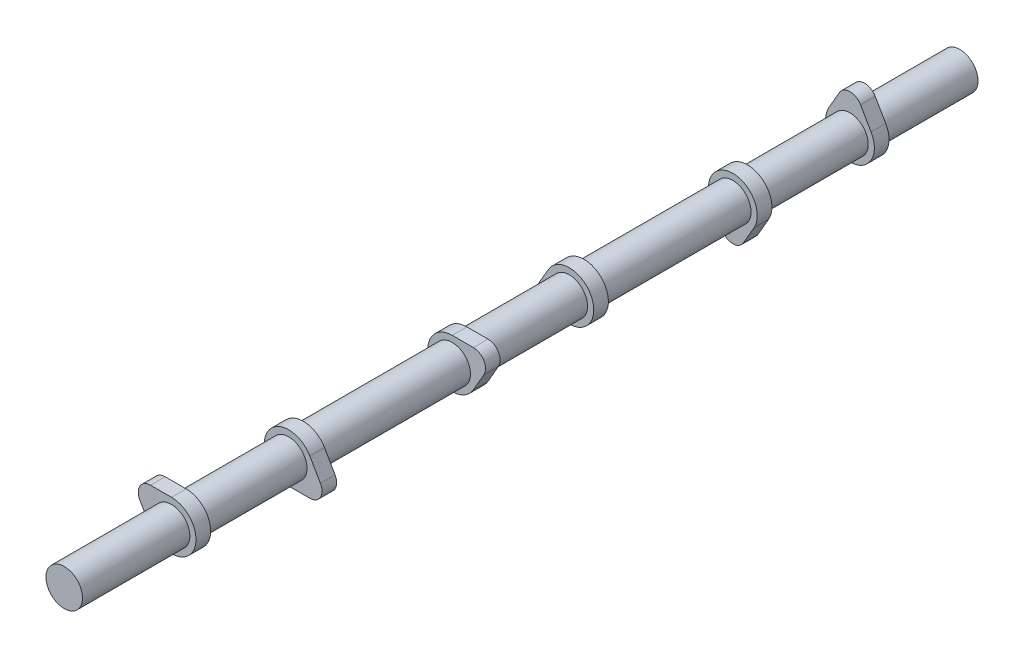
ISO-10303-21;
HEADER;
FILE_DESCRIPTION(('STEP AP214'),'2;1');
FILE_NAME('part.step','',(''),(''),'','','');
FILE_SCHEMA(('AUTOMOTIVE_DESIGN { 1 0 10303 214 1 1 1 1 }'));
ENDSEC;
DATA;
#1=APPLICATION_CONTEXT('core data for automotive mechanical design processes');
#2=APPLICATION_PROTOCOL_DEFINITION('international standard','automotive_design',2000,#1);
#3=PRODUCT_CONTEXT('',#1,'mechanical');
#4=PRODUCT('Part','Part','',(#3));
#5=PRODUCT_RELATED_PRODUCT_CATEGORY('part','',(#4));
#6=PRODUCT_DEFINITION_FORMATION('','',#4);
#7=PRODUCT_DEFINITION_CONTEXT('part definition',#1,'design');
#8=PRODUCT_DEFINITION('design','',#6,#7);
#9=PRODUCT_DEFINITION_SHAPE('','',#8);
#10=(LENGTH_UNIT() NAMED_UNIT(*) SI_UNIT(.MILLI.,.METRE.));
#11=(NAMED_UNIT(*) PLANE_ANGLE_UNIT() SI_UNIT($,.RADIAN.));
#12=(NAMED_UNIT(*) SI_UNIT($,.STERADIAN.) SOLID_ANGLE_UNIT());
#13=UNCERTAINTY_MEASURE_WITH_UNIT(LENGTH_MEASURE(1.E-05),#10,'distance_accuracy_value','');
#14=(GEOMETRIC_REPRESENTATION_CONTEXT(3) GLOBAL_UNCERTAINTY_ASSIGNED_CONTEXT((#13)) GLOBAL_UNIT_ASSIGNED_CONTEXT((#10,
#11,#12)) REPRESENTATION_CONTEXT('',''));
#15=CARTESIAN_POINT('',(0.,0.,0.));
#16=DIRECTION('',(0.,0.,1.));
#17=DIRECTION('',(1.,0.,0.));
#18=AXIS2_PLACEMENT_3D('',#15,#16,#17);
#19=CARTESIAN_POINT('',(0.,0.,412.75));
#20=DIRECTION('',(0.,0.,-1.));
#21=DIRECTION('',(0.499999999999992,0.866025403784443,0.));
#22=AXIS2_PLACEMENT_3D('',#19,#20,#21);
#23=CYLINDRICAL_SURFACE('',#22,9.5);
#24=CARTESIAN_POINT('',(0.,0.,295.91));
#25=DIRECTION('',(0.,0.,1.));
#26=DIRECTION('',(-0.499999999999992,-0.866025403784443,0.));
#27=AXIS2_PLACEMENT_3D('',#24,#25,#26);
#28=CIRCLE('',#27,9.5);
#29=CARTESIAN_POINT('',(-4.74999999999992,-8.22724133595221,295.91));
#30=VERTEX_POINT('',#29);
#31=EDGE_CURVE('E457',#30,#30,#28,.F.);
#32=ORIENTED_EDGE('',*,*,#31,.F.);
#33=EDGE_LOOP('',(#32));
#34=FACE_BOUND('',#33,.T.);
#35=CARTESIAN_POINT('',(0.,0.,349.25));
#36=DIRECTION('',(0.,0.,1.));
#37=DIRECTION('',(-0.499999999999992,-0.866025403784443,0.));
#38=AXIS2_PLACEMENT_3D('',#35,#36,#37);
#39=CIRCLE('',#38,9.5);
#40=CARTESIAN_POINT('',(-4.74999999999992,-8.22724133595221,349.25));
#41=VERTEX_POINT('',#40);
#42=EDGE_CURVE('E11',#41,#41,#39,.T.);
#43=ORIENTED_EDGE('',*,*,#42,.F.);
#44=EDGE_LOOP('',(#43));
#45=FACE_BOUND('',#44,.T.);
#46=ADVANCED_FACE('F45',(#34,#45),#23,.T.);
#47=CARTESIAN_POINT('',(10.9985226280624,-6.3499999999999,295.91));
#48=DIRECTION('',(0.,0.,-1.));
#49=DIRECTION('',(0.499999999999992,0.866025403784443,0.));
#50=AXIS2_PLACEMENT_3D('',#47,#48,#49);
#51=CYLINDRICAL_SURFACE('',#50,6.35);
#52=CARTESIAN_POINT('',(10.9985226280624,-6.3499999999999,288.29));
#53=DIRECTION('',(0.,0.,1.));
#54=DIRECTION('',(-0.499999999999992,-0.866025403784443,0.));
#55=AXIS2_PLACEMENT_3D('',#52,#53,#54);
#56=CIRCLE('',#55,6.35);
#57=CARTESIAN_POINT('',(10.9985226280625,-12.6999999999999,288.29));
#58=VERTEX_POINT('',#57);
#59=CARTESIAN_POINT('',(16.4977839420936,-3.17499999999985,288.29));
#60=VERTEX_POINT('',#59);
#61=EDGE_CURVE('E461',#58,#60,#56,.T.);
#62=ORIENTED_EDGE('',*,*,#61,.T.);
#63=DIRECTION('',(0.,0.,-1.));
#64=VECTOR('',#63,1.);
#65=CARTESIAN_POINT('',(16.4977839420936,-3.17499999999985,295.91));
#66=LINE('',#65,#64);
#67=CARTESIAN_POINT('',(16.4977839420936,-3.17499999999985,295.91));
#68=VERTEX_POINT('',#67);
#69=EDGE_CURVE('E491',#68,#60,#66,.T.);
#70=ORIENTED_EDGE('',*,*,#69,.F.);
#71=CARTESIAN_POINT('',(10.9985226280624,-6.3499999999999,295.91));
#72=DIRECTION('',(0.,0.,1.));
#73=DIRECTION('',(-0.499999999999992,-0.866025403784443,0.));
#74=AXIS2_PLACEMENT_3D('',#71,#72,#73);
#75=CIRCLE('',#74,6.35);
#76=CARTESIAN_POINT('',(10.9985226280625,-12.6999999999999,295.91));
#77=VERTEX_POINT('',#76);
#78=EDGE_CURVE('E462',#77,#68,#75,.T.);
#79=ORIENTED_EDGE('',*,*,#78,.F.);
#80=DIRECTION('',(0.,0.,-1.));
#81=VECTOR('',#80,1.);
#82=CARTESIAN_POINT('',(10.9985226280625,-12.6999999999999,295.91));
#83=LINE('',#82,#81);
#84=EDGE_CURVE('E472',#77,#58,#83,.T.);
#85=ORIENTED_EDGE('',*,*,#84,.T.);
#86=EDGE_LOOP('',(#62,#70,#79,#85));
#87=FACE_BOUND('',#86,.T.);
#88=ADVANCED_FACE('F47',(#87),#51,.T.);
#89=CARTESIAN_POINT('',(16.4977839420936,-3.17499999999985,295.91));
#90=DIRECTION('',(-0.866025403784434,-0.500000000000008,0.));
#91=DIRECTION('',(0.500000000000008,-0.866025403784434,0.));
#92=AXIS2_PLACEMENT_3D('',#89,#90,#91);
#93=PLANE('',#92);
#94=DIRECTION('',(-0.500000000000008,0.866025403784434,0.));
#95=VECTOR('',#94,1.);
#96=CARTESIAN_POINT('',(16.4977839420936,-3.17499999999985,288.29));
#97=LINE('',#96,#95);
#98=CARTESIAN_POINT('',(10.9985226280623,6.3500000000001,288.29));
#99=VERTEX_POINT('',#98);
#100=EDGE_CURVE('E476',#60,#99,#97,.T.);
#101=ORIENTED_EDGE('',*,*,#100,.T.);
#102=DIRECTION('',(0.,0.,-1.));
#103=VECTOR('',#102,1.);
#104=CARTESIAN_POINT('',(10.9985226280623,6.3500000000001,295.91));
#105=LINE('',#104,#103);
#106=CARTESIAN_POINT('',(10.9985226280623,6.3500000000001,295.91));
#107=VERTEX_POINT('',#106);
#108=EDGE_CURVE('E488',#107,#99,#105,.T.);
#109=ORIENTED_EDGE('',*,*,#108,.F.);
#110=DIRECTION('',(-0.500000000000008,0.866025403784434,0.));
#111=VECTOR('',#110,1.);
#112=CARTESIAN_POINT('',(16.4977839420936,-3.17499999999985,295.91));
#113=LINE('',#112,#111);
#114=EDGE_CURVE('E96',#68,#107,#113,.T.);
#115=ORIENTED_EDGE('',*,*,#114,.F.);
#116=ORIENTED_EDGE('',*,*,#69,.T.);
#117=EDGE_LOOP('',(#101,#109,#115,#116));
#118=FACE_BOUND('',#117,.T.);
#119=ADVANCED_FACE('F513',(#118),#93,.F.);
#120=CARTESIAN_POINT('',(0.,0.,295.91));
#121=DIRECTION('',(0.,0.,-1.));
#122=DIRECTION('',(0.499999999999992,0.866025403784443,0.));
#123=AXIS2_PLACEMENT_3D('',#120,#121,#122);
#124=CYLINDRICAL_SURFACE('',#123,12.7);
#125=CARTESIAN_POINT('',(0.,0.,288.29));
#126=DIRECTION('',(0.,0.,1.));
#127=DIRECTION('',(-0.499999999999992,-0.866025403784443,0.));
#128=AXIS2_PLACEMENT_3D('',#125,#126,#127);
#129=CIRCLE('',#128,12.7);
#130=CARTESIAN_POINT('',(1.196959198424E-13,-12.7,288.29));
#131=VERTEX_POINT('',#130);
#132=EDGE_CURVE('E82',#99,#131,#129,.T.);
#133=ORIENTED_EDGE('',*,*,#132,.T.);
#134=DIRECTION('',(0.,0.,-1.));
#135=VECTOR('',#134,1.);
#136=CARTESIAN_POINT('',(1.196959198424E-13,-12.7,295.91));
#137=LINE('',#136,#135);
#138=CARTESIAN_POINT('',(1.196959198424E-13,-12.7,295.91));
#139=VERTEX_POINT('',#138);
#140=EDGE_CURVE('E485',#139,#131,#137,.T.);
#141=ORIENTED_EDGE('',*,*,#140,.F.);
#142=CARTESIAN_POINT('',(0.,0.,295.91));
#143=DIRECTION('',(0.,0.,1.));
#144=DIRECTION('',(-0.499999999999992,-0.866025403784443,0.));
#145=AXIS2_PLACEMENT_3D('',#142,#143,#144);
#146=CIRCLE('',#145,12.7);
#147=EDGE_CURVE('E467',#107,#139,#146,.T.);
#148=ORIENTED_EDGE('',*,*,#147,.F.);
#149=ORIENTED_EDGE('',*,*,#108,.T.);
#150=EDGE_LOOP('',(#133,#141,#148,#149));
#151=FACE_BOUND('',#150,.T.);
#152=ADVANCED_FACE('F512',(#151),#124,.T.);
#153=CARTESIAN_POINT('',(10.9985226280625,-12.6999999999999,295.91));
#154=DIRECTION('',(0.,1.,0.));
#155=DIRECTION('',(-1.,0.,0.));
#156=AXIS2_PLACEMENT_3D('',#153,#154,#155);
#157=PLANE('',#156);
#158=DIRECTION('',(1.,0.,0.));
#159=VECTOR('',#158,1.);
#160=CARTESIAN_POINT('',(10.9985226280625,-12.6999999999999,288.29));
#161=LINE('',#160,#159);
#162=EDGE_CURVE('E88',#131,#58,#161,.T.);
#163=ORIENTED_EDGE('',*,*,#162,.T.);
#164=ORIENTED_EDGE('',*,*,#84,.F.);
#165=DIRECTION('',(1.,0.,0.));
#166=VECTOR('',#165,1.);
#167=CARTESIAN_POINT('',(10.9985226280625,-12.6999999999999,295.91));
#168=LINE('',#167,#166);
#169=EDGE_CURVE('E64',#139,#77,#168,.T.);
#170=ORIENTED_EDGE('',*,*,#169,.F.);
#171=ORIENTED_EDGE('',*,*,#140,.T.);
#172=EDGE_LOOP('',(#163,#164,#170,#171));
#173=FACE_BOUND('',#172,.T.);
#174=ADVANCED_FACE('F510',(#173),#157,.F.);
#175=CARTESIAN_POINT('',(10.9985226280624,-6.3499999999999,295.91));
#176=DIRECTION('',(0.,0.,1.));
#177=DIRECTION('',(-0.499999999999992,-0.866025403784443,0.));
#178=AXIS2_PLACEMENT_3D('',#175,#176,#177);
#179=PLANE('',#178);
#180=ORIENTED_EDGE('',*,*,#31,.T.);
#181=EDGE_LOOP('',(#180));
#182=FACE_BOUND('',#181,.T.);
#183=ORIENTED_EDGE('',*,*,#78,.T.);
#184=ORIENTED_EDGE('',*,*,#114,.T.);
#185=ORIENTED_EDGE('',*,*,#147,.T.);
#186=ORIENTED_EDGE('',*,*,#169,.T.);
#187=EDGE_LOOP('',(#183,#184,#185,#186));
#188=FACE_BOUND('',#187,.T.);
#189=ADVANCED_FACE('F504',(#182,#188),#179,.T.);
#190=CARTESIAN_POINT('',(10.9985226280624,-6.3499999999999,288.29));
#191=DIRECTION('',(0.,0.,1.));
#192=DIRECTION('',(-0.499999999999992,-0.866025403784443,0.));
#193=AXIS2_PLACEMENT_3D('',#190,#191,#192);
#194=PLANE('',#193);
#195=CARTESIAN_POINT('',(0.,0.,288.29));
#196=DIRECTION('',(0.,0.,1.));
#197=DIRECTION('',(-0.499999999999992,-0.866025403784443,0.));
#198=AXIS2_PLACEMENT_3D('',#195,#196,#197);
#199=CIRCLE('',#198,9.5);
#200=CARTESIAN_POINT('',(-4.74999999999992,-8.22724133595221,288.29));
#201=VERTEX_POINT('',#200);
#202=EDGE_CURVE('E56',#201,#201,#199,.F.);
#203=ORIENTED_EDGE('',*,*,#202,.F.);
#204=EDGE_LOOP('',(#203));
#205=FACE_BOUND('',#204,.T.);
#206=ORIENTED_EDGE('',*,*,#61,.F.);
#207=ORIENTED_EDGE('',*,*,#162,.F.);
#208=ORIENTED_EDGE('',*,*,#132,.F.);
#209=ORIENTED_EDGE('',*,*,#100,.F.);
#210=EDGE_LOOP('',(#206,#207,#208,#209));
#211=FACE_BOUND('',#210,.T.);
#212=ADVANCED_FACE('F501',(#205,#211),#194,.F.);
#213=ORIENTED_EDGE('',*,*,#202,.T.);
#214=EDGE_LOOP('',(#213));
#215=FACE_BOUND('',#214,.T.);
#216=CARTESIAN_POINT('',(0.,0.,210.82));
#217=DIRECTION('',(0.,0.,1.));
#218=DIRECTION('',(-0.500000000000004,0.866025403784436,0.));
#219=AXIS2_PLACEMENT_3D('',#216,#217,#218);
#220=CIRCLE('',#219,9.5);
#221=CARTESIAN_POINT('',(-4.75000000000004,8.22724133595215,210.82));
#222=VERTEX_POINT('',#221);
#223=EDGE_CURVE('E353',#222,#222,#220,.T.);
#224=ORIENTED_EDGE('',*,*,#223,.T.);
#225=EDGE_LOOP('',(#224));
#226=FACE_BOUND('',#225,.T.);
#227=ADVANCED_FACE('F498',(#215,#226),#23,.T.);
#228=CARTESIAN_POINT('',(-10.9985226280624,6.34999999999997,356.87));
#229=DIRECTION('',(0.,0.,-1.));
#230=DIRECTION('',(-0.499999999999998,-0.86602540378444,0.));
#231=AXIS2_PLACEMENT_3D('',#228,#229,#230);
#232=CYLINDRICAL_SURFACE('',#231,6.35);
#233=CARTESIAN_POINT('',(-10.9985226280624,6.34999999999997,349.25));
#234=DIRECTION('',(0.,0.,1.));
#235=DIRECTION('',(0.499999999999998,0.86602540378444,0.));
#236=AXIS2_PLACEMENT_3D('',#233,#234,#235);
#237=CIRCLE('',#236,6.35);
#238=CARTESIAN_POINT('',(-10.9985226280624,12.7,349.25));
#239=VERTEX_POINT('',#238);
#240=CARTESIAN_POINT('',(-16.4977839420936,3.17499999999996,349.25));
#241=VERTEX_POINT('',#240);
#242=EDGE_CURVE('E408',#239,#241,#237,.T.);
#243=ORIENTED_EDGE('',*,*,#242,.T.);
#244=DIRECTION('',(0.,0.,-1.));
#245=VECTOR('',#244,1.);
#246=CARTESIAN_POINT('',(-16.4977839420936,3.17499999999996,356.87));
#247=LINE('',#246,#245);
#248=CARTESIAN_POINT('',(-16.4977839420936,3.17499999999996,356.87));
#249=VERTEX_POINT('',#248);
#250=EDGE_CURVE('E449',#249,#241,#247,.T.);
#251=ORIENTED_EDGE('',*,*,#250,.F.);
#252=CARTESIAN_POINT('',(-10.9985226280624,6.34999999999997,356.87));
#253=DIRECTION('',(0.,0.,1.));
#254=DIRECTION('',(0.499999999999998,0.86602540378444,0.));
#255=AXIS2_PLACEMENT_3D('',#252,#253,#254);
#256=CIRCLE('',#255,6.35);
#257=CARTESIAN_POINT('',(-10.9985226280624,12.7,356.87));
#258=VERTEX_POINT('',#257);
#259=EDGE_CURVE('E412',#258,#249,#256,.T.);
#260=ORIENTED_EDGE('',*,*,#259,.F.);
#261=DIRECTION('',(0.,0.,-1.));
#262=VECTOR('',#261,1.);
#263=CARTESIAN_POINT('',(-10.9985226280624,12.7,356.87));
#264=LINE('',#263,#262);
#265=EDGE_CURVE('E426',#258,#239,#264,.T.);
#266=ORIENTED_EDGE('',*,*,#265,.T.);
#267=EDGE_LOOP('',(#243,#251,#260,#266));
#268=FACE_BOUND('',#267,.T.);
#269=ADVANCED_FACE('F531',(#268),#232,.T.);
#270=CARTESIAN_POINT('',(-16.4977839420936,3.17499999999996,356.87));
#271=DIRECTION('',(0.866025403784437,0.500000000000002,0.));
#272=DIRECTION('',(-0.500000000000002,0.866025403784437,0.));
#273=AXIS2_PLACEMENT_3D('',#270,#271,#272);
#274=PLANE('',#273);
#275=DIRECTION('',(0.500000000000002,-0.866025403784437,0.));
#276=VECTOR('',#275,1.);
#277=CARTESIAN_POINT('',(-16.4977839420936,3.17499999999996,349.25));
#278=LINE('',#277,#276);
#279=CARTESIAN_POINT('',(-10.9985226280624,-6.35000000000002,349.25));
#280=VERTEX_POINT('',#279);
#281=EDGE_CURVE('E430',#241,#280,#278,.T.);
#282=ORIENTED_EDGE('',*,*,#281,.T.);
#283=DIRECTION('',(0.,0.,-1.));
#284=VECTOR('',#283,1.);
#285=CARTESIAN_POINT('',(-10.9985226280624,-6.35000000000002,356.87));
#286=LINE('',#285,#284);
#287=CARTESIAN_POINT('',(-10.9985226280624,-6.35000000000002,356.87));
#288=VERTEX_POINT('',#287);
#289=EDGE_CURVE('E445',#288,#280,#286,.T.);
#290=ORIENTED_EDGE('',*,*,#289,.F.);
#291=DIRECTION('',(0.500000000000002,-0.866025403784437,0.));
#292=VECTOR('',#291,1.);
#293=CARTESIAN_POINT('',(-16.4977839420936,3.17499999999996,356.87));
#294=LINE('',#293,#292);
#295=EDGE_CURVE('E416',#249,#288,#294,.T.);
#296=ORIENTED_EDGE('',*,*,#295,.F.);
#297=ORIENTED_EDGE('',*,*,#250,.T.);
#298=EDGE_LOOP('',(#282,#290,#296,#297));
#299=FACE_BOUND('',#298,.T.);
#300=ADVANCED_FACE('F565',(#299),#274,.F.);
#301=CARTESIAN_POINT('',(0.,0.,356.87));
#302=DIRECTION('',(0.,0.,-1.));
#303=DIRECTION('',(-0.499999999999998,-0.86602540378444,0.));
#304=AXIS2_PLACEMENT_3D('',#301,#302,#303);
#305=CYLINDRICAL_SURFACE('',#304,12.7);
#306=CARTESIAN_POINT('',(0.,0.,349.25));
#307=DIRECTION('',(0.,0.,1.));
#308=DIRECTION('',(0.499999999999998,0.86602540378444,0.));
#309=AXIS2_PLACEMENT_3D('',#306,#307,#308);
#310=CIRCLE('',#309,12.7);
#311=CARTESIAN_POINT('',(0.,12.7,349.25));
#312=VERTEX_POINT('',#311);
#313=EDGE_CURVE('E433',#280,#312,#310,.T.);
#314=ORIENTED_EDGE('',*,*,#313,.T.);
#315=DIRECTION('',(0.,0.,-1.));
#316=VECTOR('',#315,1.);
#317=CARTESIAN_POINT('',(0.,12.7,356.87));
#318=LINE('',#317,#316);
#319=CARTESIAN_POINT('',(0.,12.7,356.87));
#320=VERTEX_POINT('',#319);
#321=EDGE_CURVE('E441',#320,#312,#318,.T.);
#322=ORIENTED_EDGE('',*,*,#321,.F.);
#323=CARTESIAN_POINT('',(0.,0.,356.87));
#324=DIRECTION('',(0.,0.,1.));
#325=DIRECTION('',(0.499999999999998,0.86602540378444,0.));
#326=AXIS2_PLACEMENT_3D('',#323,#324,#325);
#327=CIRCLE('',#326,12.7);
#328=EDGE_CURVE('E420',#288,#320,#327,.T.);
#329=ORIENTED_EDGE('',*,*,#328,.F.);
#330=ORIENTED_EDGE('',*,*,#289,.T.);
#331=EDGE_LOOP('',(#314,#322,#329,#330));
#332=FACE_BOUND('',#331,.T.);
#333=ADVANCED_FACE('F570',(#332),#305,.T.);
#334=CARTESIAN_POINT('',(-10.9985226280624,12.7,356.87));
#335=DIRECTION('',(0.,-1.,0.));
#336=DIRECTION('',(1.,0.,0.));
#337=AXIS2_PLACEMENT_3D('',#334,#335,#336);
#338=PLANE('',#337);
#339=DIRECTION('',(-1.,0.,0.));
#340=VECTOR('',#339,1.);
#341=CARTESIAN_POINT('',(-10.9985226280624,12.7,349.25));
#342=LINE('',#341,#340);
#343=EDGE_CURVE('E417',#312,#239,#342,.T.);
#344=ORIENTED_EDGE('',*,*,#343,.T.);
#345=ORIENTED_EDGE('',*,*,#265,.F.);
#346=DIRECTION('',(-1.,0.,0.));
#347=VECTOR('',#346,1.);
#348=CARTESIAN_POINT('',(-10.9985226280624,12.7,356.87));
#349=LINE('',#348,#347);
#350=EDGE_CURVE('E423',#320,#258,#349,.T.);
#351=ORIENTED_EDGE('',*,*,#350,.F.);
#352=ORIENTED_EDGE('',*,*,#321,.T.);
#353=EDGE_LOOP('',(#344,#345,#351,#352));
#354=FACE_BOUND('',#353,.T.);
#355=ADVANCED_FACE('F555',(#354),#338,.F.);
#356=CARTESIAN_POINT('',(-10.9985226280624,6.34999999999997,356.87));
#357=DIRECTION('',(0.,0.,1.));
#358=DIRECTION('',(0.499999999999998,0.86602540378444,0.));
#359=AXIS2_PLACEMENT_3D('',#356,#357,#358);
#360=PLANE('',#359);
#361=CARTESIAN_POINT('',(0.,0.,356.87));
#362=DIRECTION('',(0.,0.,1.));
#363=DIRECTION('',(-0.499999999999992,-0.866025403784443,0.));
#364=AXIS2_PLACEMENT_3D('',#361,#362,#363);
#365=CIRCLE('',#364,9.5);
#366=CARTESIAN_POINT('',(-4.74999999999992,-8.22724133595221,356.87));
#367=VERTEX_POINT('',#366);
#368=EDGE_CURVE('E49',#367,#367,#365,.T.);
#369=ORIENTED_EDGE('',*,*,#368,.F.);
#370=EDGE_LOOP('',(#369));
#371=FACE_BOUND('',#370,.T.);
#372=ORIENTED_EDGE('',*,*,#259,.T.);
#373=ORIENTED_EDGE('',*,*,#295,.T.);
#374=ORIENTED_EDGE('',*,*,#328,.T.);
#375=ORIENTED_EDGE('',*,*,#350,.T.);
#376=EDGE_LOOP('',(#372,#373,#374,#375));
#377=FACE_BOUND('',#376,.T.);
#378=ADVANCED_FACE('F552',(#371,#377),#360,.T.);
#379=CARTESIAN_POINT('',(-10.9985226280624,6.34999999999997,349.25));
#380=DIRECTION('',(0.,0.,1.));
#381=DIRECTION('',(0.499999999999998,0.86602540378444,0.));
#382=AXIS2_PLACEMENT_3D('',#379,#380,#381);
#383=PLANE('',#382);
#384=ORIENTED_EDGE('',*,*,#42,.T.);
#385=EDGE_LOOP('',(#384));
#386=FACE_BOUND('',#385,.T.);
#387=ORIENTED_EDGE('',*,*,#242,.F.);
#388=ORIENTED_EDGE('',*,*,#343,.F.);
#389=ORIENTED_EDGE('',*,*,#313,.F.);
#390=ORIENTED_EDGE('',*,*,#281,.F.);
#391=EDGE_LOOP('',(#387,#388,#389,#390));
#392=FACE_BOUND('',#391,.T.);
#393=ADVANCED_FACE('F544',(#386,#392),#383,.F.);
#394=CARTESIAN_POINT('',(0.,0.,412.75));
#395=DIRECTION('',(0.,0.,1.));
#396=DIRECTION('',(-0.499999999999992,-0.866025403784443,0.));
#397=AXIS2_PLACEMENT_3D('',#394,#395,#396);
#398=PLANE('',#397);
#399=CARTESIAN_POINT('',(0.,0.,412.75));
#400=DIRECTION('',(0.,0.,1.));
#401=DIRECTION('',(-0.499999999999992,-0.866025403784443,0.));
#402=AXIS2_PLACEMENT_3D('',#399,#400,#401);
#403=CIRCLE('',#402,9.5);
#404=CARTESIAN_POINT('',(-4.74999999999992,-8.22724133595221,412.75));
#405=VERTEX_POINT('',#404);
#406=EDGE_CURVE('E453',#405,#405,#403,.T.);
#407=ORIENTED_EDGE('',*,*,#406,.T.);
#408=EDGE_LOOP('',(#407));
#409=FACE_BOUND('',#408,.T.);
#410=ADVANCED_FACE('F534',(#409),#398,.T.);
#411=ORIENTED_EDGE('',*,*,#368,.T.);
#412=EDGE_LOOP('',(#411));
#413=FACE_BOUND('',#412,.T.);
#414=ORIENTED_EDGE('',*,*,#406,.F.);
#415=EDGE_LOOP('',(#414));
#416=FACE_BOUND('',#415,.T.);
#417=ADVANCED_FACE('F523',(#413,#416),#23,.T.);
#418=CARTESIAN_POINT('',(0.,0.,266.7));
#419=DIRECTION('',(0.,0.,-1.));
#420=DIRECTION('',(0.500000000000004,-0.866025403784436,0.));
#421=AXIS2_PLACEMENT_3D('',#418,#419,#420);
#422=CYLINDRICAL_SURFACE('',#421,9.5);
#423=CARTESIAN_POINT('',(0.,0.,149.86));
#424=DIRECTION('',(0.,0.,1.));
#425=DIRECTION('',(-0.500000000000004,0.866025403784436,0.));
#426=AXIS2_PLACEMENT_3D('',#423,#424,#425);
#427=CIRCLE('',#426,9.5);
#428=CARTESIAN_POINT('',(-4.75000000000004,8.22724133595215,149.86));
#429=VERTEX_POINT('',#428);
#430=EDGE_CURVE('E354',#429,#429,#427,.F.);
#431=ORIENTED_EDGE('',*,*,#430,.F.);
#432=EDGE_LOOP('',(#431));
#433=FACE_BOUND('',#432,.T.);
#434=CARTESIAN_POINT('',(0.,0.,203.2));
#435=DIRECTION('',(0.,0.,1.));
#436=DIRECTION('',(-0.500000000000004,0.866025403784436,0.));
#437=AXIS2_PLACEMENT_3D('',#434,#435,#436);
#438=CIRCLE('',#437,9.5);
#439=CARTESIAN_POINT('',(-4.75000000000004,8.22724133595215,203.2));
#440=VERTEX_POINT('',#439);
#441=EDGE_CURVE('E404',#440,#440,#438,.T.);
#442=ORIENTED_EDGE('',*,*,#441,.F.);
#443=EDGE_LOOP('',(#442));
#444=FACE_BOUND('',#443,.T.);
#445=ADVANCED_FACE('F533',(#433,#444),#422,.T.);
#446=CARTESIAN_POINT('',(-10.9985226280623,-6.35000000000005,149.86));
#447=DIRECTION('',(0.,0.,-1.));
#448=DIRECTION('',(0.500000000000004,-0.866025403784436,0.));
#449=AXIS2_PLACEMENT_3D('',#446,#447,#448);
#450=CYLINDRICAL_SURFACE('',#449,6.35);
#451=CARTESIAN_POINT('',(-10.9985226280623,-6.35000000000005,142.24));
#452=DIRECTION('',(0.,0.,1.));
#453=DIRECTION('',(-0.500000000000004,0.866025403784436,0.));
#454=AXIS2_PLACEMENT_3D('',#451,#452,#453);
#455=CIRCLE('',#454,6.35);
#456=CARTESIAN_POINT('',(-16.4977839420935,-3.17500000000008,142.24));
#457=VERTEX_POINT('',#456);
#458=CARTESIAN_POINT('',(-10.9985226280623,-12.7000000000001,142.24));
#459=VERTEX_POINT('',#458);
#460=EDGE_CURVE('E358',#457,#459,#455,.T.);
#461=ORIENTED_EDGE('',*,*,#460,.T.);
#462=DIRECTION('',(0.,0.,-1.));
#463=VECTOR('',#462,1.);
#464=CARTESIAN_POINT('',(-10.9985226280623,-12.7000000000001,149.86));
#465=LINE('',#464,#463);
#466=CARTESIAN_POINT('',(-10.9985226280623,-12.7000000000001,149.86));
#467=VERTEX_POINT('',#466);
#468=EDGE_CURVE('E396',#467,#459,#465,.T.);
#469=ORIENTED_EDGE('',*,*,#468,.F.);
#470=CARTESIAN_POINT('',(-10.9985226280623,-6.35000000000005,149.86));
#471=DIRECTION('',(0.,0.,1.));
#472=DIRECTION('',(-0.500000000000004,0.866025403784436,0.));
#473=AXIS2_PLACEMENT_3D('',#470,#471,#472);
#474=CIRCLE('',#473,6.35);
#475=CARTESIAN_POINT('',(-16.4977839420935,-3.17500000000008,149.86));
#476=VERTEX_POINT('',#475);
#477=EDGE_CURVE('E359',#476,#467,#474,.T.);
#478=ORIENTED_EDGE('',*,*,#477,.F.);
#479=DIRECTION('',(0.,0.,-1.));
#480=VECTOR('',#479,1.);
#481=CARTESIAN_POINT('',(-16.4977839420935,-3.17500000000008,149.86));
#482=LINE('',#481,#480);
#483=EDGE_CURVE('E373',#476,#457,#482,.T.);
#484=ORIENTED_EDGE('',*,*,#483,.T.);
#485=EDGE_LOOP('',(#461,#469,#478,#484));
#486=FACE_BOUND('',#485,.T.);
#487=ADVANCED_FACE('F540',(#486),#450,.T.);
#488=CARTESIAN_POINT('',(-10.9985226280623,-12.7000000000001,149.86));
#489=DIRECTION('',(0.,1.,0.));
#490=DIRECTION('',(-1.,0.,0.));
#491=AXIS2_PLACEMENT_3D('',#488,#489,#490);
#492=PLANE('',#491);
#493=DIRECTION('',(1.,0.,0.));
#494=VECTOR('',#493,1.);
#495=CARTESIAN_POINT('',(-10.9985226280623,-12.7000000000001,142.24));
#496=LINE('',#495,#494);
#497=CARTESIAN_POINT('',(0.,-12.7,142.24));
#498=VERTEX_POINT('',#497);
#499=EDGE_CURVE('E377',#459,#498,#496,.T.);
#500=ORIENTED_EDGE('',*,*,#499,.T.);
#501=DIRECTION('',(0.,0.,-1.));
#502=VECTOR('',#501,1.);
#503=CARTESIAN_POINT('',(0.,-12.7,149.86));
#504=LINE('',#503,#502);
#505=CARTESIAN_POINT('',(0.,-12.7,149.86));
#506=VERTEX_POINT('',#505);
#507=EDGE_CURVE('E392',#506,#498,#504,.T.);
#508=ORIENTED_EDGE('',*,*,#507,.F.);
#509=DIRECTION('',(1.,0.,0.));
#510=VECTOR('',#509,1.);
#511=CARTESIAN_POINT('',(-10.9985226280623,-12.7000000000001,149.86));
#512=LINE('',#511,#510);
#513=EDGE_CURVE('E363',#467,#506,#512,.T.);
#514=ORIENTED_EDGE('',*,*,#513,.F.);
#515=ORIENTED_EDGE('',*,*,#468,.T.);
#516=EDGE_LOOP('',(#500,#508,#514,#515));
#517=FACE_BOUND('',#516,.T.);
#518=ADVANCED_FACE('F669',(#517),#492,.F.);
#519=CARTESIAN_POINT('',(0.,0.,149.86));
#520=DIRECTION('',(0.,0.,-1.));
#521=DIRECTION('',(0.500000000000004,-0.866025403784436,0.));
#522=AXIS2_PLACEMENT_3D('',#519,#520,#521);
#523=CYLINDRICAL_SURFACE('',#522,12.7);
#524=CARTESIAN_POINT('',(0.,0.,142.24));
#525=DIRECTION('',(0.,0.,1.));
#526=DIRECTION('',(-0.500000000000004,0.866025403784436,0.));
#527=AXIS2_PLACEMENT_3D('',#524,#525,#526);
#528=CIRCLE('',#527,12.7);
#529=CARTESIAN_POINT('',(-10.9985226280624,6.34999999999995,142.24));
#530=VERTEX_POINT('',#529);
#531=EDGE_CURVE('E380',#498,#530,#528,.T.);
#532=ORIENTED_EDGE('',*,*,#531,.T.);
#533=DIRECTION('',(0.,0.,-1.));
#534=VECTOR('',#533,1.);
#535=CARTESIAN_POINT('',(-10.9985226280624,6.34999999999995,149.86));
#536=LINE('',#535,#534);
#537=CARTESIAN_POINT('',(-10.9985226280624,6.34999999999995,149.86));
#538=VERTEX_POINT('',#537);
#539=EDGE_CURVE('E388',#538,#530,#536,.T.);
#540=ORIENTED_EDGE('',*,*,#539,.F.);
#541=CARTESIAN_POINT('',(0.,0.,149.86));
#542=DIRECTION('',(0.,0.,1.));
#543=DIRECTION('',(-0.500000000000004,0.866025403784436,0.));
#544=AXIS2_PLACEMENT_3D('',#541,#542,#543);
#545=CIRCLE('',#544,12.7);
#546=EDGE_CURVE('E367',#506,#538,#545,.T.);
#547=ORIENTED_EDGE('',*,*,#546,.F.);
#548=ORIENTED_EDGE('',*,*,#507,.T.);
#549=EDGE_LOOP('',(#532,#540,#547,#548));
#550=FACE_BOUND('',#549,.T.);
#551=ADVANCED_FACE('F678',(#550),#523,.T.);
#552=CARTESIAN_POINT('',(-16.4977839420935,-3.17500000000008,149.86));
#553=DIRECTION('',(0.866025403784441,-0.499999999999996,0.));
#554=DIRECTION('',(0.499999999999996,0.866025403784441,0.));
#555=AXIS2_PLACEMENT_3D('',#552,#553,#554);
#556=PLANE('',#555);
#557=DIRECTION('',(-0.499999999999996,-0.866025403784441,0.));
#558=VECTOR('',#557,1.);
#559=CARTESIAN_POINT('',(-16.4977839420935,-3.17500000000008,142.24));
#560=LINE('',#559,#558);
#561=EDGE_CURVE('E364',#530,#457,#560,.T.);
#562=ORIENTED_EDGE('',*,*,#561,.T.);
#563=ORIENTED_EDGE('',*,*,#483,.F.);
#564=DIRECTION('',(-0.499999999999996,-0.866025403784441,0.));
#565=VECTOR('',#564,1.);
#566=CARTESIAN_POINT('',(-16.4977839420935,-3.17500000000008,149.86));
#567=LINE('',#566,#565);
#568=EDGE_CURVE('E370',#538,#476,#567,.T.);
#569=ORIENTED_EDGE('',*,*,#568,.F.);
#570=ORIENTED_EDGE('',*,*,#539,.T.);
#571=EDGE_LOOP('',(#562,#563,#569,#570));
#572=FACE_BOUND('',#571,.T.);
#573=ADVANCED_FACE('F688',(#572),#556,.F.);
#574=CARTESIAN_POINT('',(-10.9985226280623,-6.35000000000005,149.86));
#575=DIRECTION('',(0.,0.,1.));
#576=DIRECTION('',(-0.500000000000004,0.866025403784436,0.));
#577=AXIS2_PLACEMENT_3D('',#574,#575,#576);
#578=PLANE('',#577);
#579=ORIENTED_EDGE('',*,*,#430,.T.);
#580=EDGE_LOOP('',(#579));
#581=FACE_BOUND('',#580,.T.);
#582=ORIENTED_EDGE('',*,*,#477,.T.);
#583=ORIENTED_EDGE('',*,*,#513,.T.);
#584=ORIENTED_EDGE('',*,*,#546,.T.);
#585=ORIENTED_EDGE('',*,*,#568,.T.);
#586=EDGE_LOOP('',(#582,#583,#584,#585));
#587=FACE_BOUND('',#586,.T.);
#588=ADVANCED_FACE('F698',(#581,#587),#578,.T.);
#589=CARTESIAN_POINT('',(-10.9985226280623,-6.35000000000005,142.24));
#590=DIRECTION('',(0.,0.,1.));
#591=DIRECTION('',(-0.500000000000004,0.866025403784436,0.));
#592=AXIS2_PLACEMENT_3D('',#589,#590,#591);
#593=PLANE('',#592);
#594=CARTESIAN_POINT('',(0.,0.,142.24));
#595=DIRECTION('',(0.,0.,1.));
#596=DIRECTION('',(-0.500000000000004,0.866025403784436,0.));
#597=AXIS2_PLACEMENT_3D('',#594,#595,#596);
#598=CIRCLE('',#597,9.5);
#599=CARTESIAN_POINT('',(-4.75000000000004,8.22724133595215,142.24));
#600=VERTEX_POINT('',#599);
#601=EDGE_CURVE('E400',#600,#600,#598,.F.);
#602=ORIENTED_EDGE('',*,*,#601,.F.);
#603=EDGE_LOOP('',(#602));
#604=FACE_BOUND('',#603,.T.);
#605=ORIENTED_EDGE('',*,*,#460,.F.);
#606=ORIENTED_EDGE('',*,*,#561,.F.);
#607=ORIENTED_EDGE('',*,*,#531,.F.);
#608=ORIENTED_EDGE('',*,*,#499,.F.);
#609=EDGE_LOOP('',(#605,#606,#607,#608));
#610=FACE_BOUND('',#609,.T.);
#611=ADVANCED_FACE('F708',(#604,#610),#593,.F.);
#612=ORIENTED_EDGE('',*,*,#601,.T.);
#613=EDGE_LOOP('',(#612));
#614=FACE_BOUND('',#613,.T.);
#615=CARTESIAN_POINT('',(0.,0.,64.77));
#616=DIRECTION('',(0.,0.,1.));
#617=DIRECTION('',(1.,0.,0.));
#618=AXIS2_PLACEMENT_3D('',#615,#616,#617);
#619=CIRCLE('',#618,9.5);
#620=CARTESIAN_POINT('',(9.5,0.,64.77));
#621=VERTEX_POINT('',#620);
#622=EDGE_CURVE('E247',#621,#621,#619,.T.);
#623=ORIENTED_EDGE('',*,*,#622,.T.);
#624=EDGE_LOOP('',(#623));
#625=FACE_BOUND('',#624,.T.);
#626=ADVANCED_FACE('F543',(#614,#625),#422,.T.);
#627=CARTESIAN_POINT('',(10.9985226280624,6.34999999999997,210.82));
#628=DIRECTION('',(0.,0.,-1.));
#629=DIRECTION('',(-0.499999999999998,0.86602540378444,0.));
#630=AXIS2_PLACEMENT_3D('',#627,#628,#629);
#631=CYLINDRICAL_SURFACE('',#630,6.35);
#632=CARTESIAN_POINT('',(10.9985226280624,6.34999999999997,203.2));
#633=DIRECTION('',(0.,0.,1.));
#634=DIRECTION('',(0.499999999999998,-0.86602540378444,0.));
#635=AXIS2_PLACEMENT_3D('',#632,#633,#634);
#636=CIRCLE('',#635,6.35);
#637=CARTESIAN_POINT('',(16.4977839420936,3.17499999999996,203.2));
#638=VERTEX_POINT('',#637);
#639=CARTESIAN_POINT('',(10.9985226280624,12.7,203.2));
#640=VERTEX_POINT('',#639);
#641=EDGE_CURVE('E310',#638,#640,#636,.T.);
#642=ORIENTED_EDGE('',*,*,#641,.T.);
#643=DIRECTION('',(0.,0.,-1.));
#644=VECTOR('',#643,1.);
#645=CARTESIAN_POINT('',(10.9985226280624,12.7,210.82));
#646=LINE('',#645,#644);
#647=CARTESIAN_POINT('',(10.9985226280624,12.7,210.82));
#648=VERTEX_POINT('',#647);
#649=EDGE_CURVE('E349',#648,#640,#646,.T.);
#650=ORIENTED_EDGE('',*,*,#649,.F.);
#651=CARTESIAN_POINT('',(10.9985226280624,6.34999999999997,210.82));
#652=DIRECTION('',(0.,0.,1.));
#653=DIRECTION('',(0.499999999999998,-0.86602540378444,0.));
#654=AXIS2_PLACEMENT_3D('',#651,#652,#653);
#655=CIRCLE('',#654,6.35);
#656=CARTESIAN_POINT('',(16.4977839420936,3.17499999999996,210.82));
#657=VERTEX_POINT('',#656);
#658=EDGE_CURVE('E312',#657,#648,#655,.T.);
#659=ORIENTED_EDGE('',*,*,#658,.F.);
#660=DIRECTION('',(0.,0.,-1.));
#661=VECTOR('',#660,1.);
#662=CARTESIAN_POINT('',(16.4977839420936,3.17499999999996,210.82));
#663=LINE('',#662,#661);
#664=EDGE_CURVE('E326',#657,#638,#663,.T.);
#665=ORIENTED_EDGE('',*,*,#664,.T.);
#666=EDGE_LOOP('',(#642,#650,#659,#665));
#667=FACE_BOUND('',#666,.T.);
#668=ADVANCED_FACE('F728',(#667),#631,.T.);
#669=CARTESIAN_POINT('',(10.9985226280624,12.7,210.82));
#670=DIRECTION('',(0.,-1.,0.));
#671=DIRECTION('',(1.,0.,0.));
#672=AXIS2_PLACEMENT_3D('',#669,#670,#671);
#673=PLANE('',#672);
#674=DIRECTION('',(-1.,0.,0.));
#675=VECTOR('',#674,1.);
#676=CARTESIAN_POINT('',(10.9985226280624,12.7,203.2));
#677=LINE('',#676,#675);
#678=CARTESIAN_POINT('',(0.,12.7,203.2));
#679=VERTEX_POINT('',#678);
#680=EDGE_CURVE('E330',#640,#679,#677,.T.);
#681=ORIENTED_EDGE('',*,*,#680,.T.);
#682=DIRECTION('',(0.,0.,-1.));
#683=VECTOR('',#682,1.);
#684=CARTESIAN_POINT('',(0.,12.7,210.82));
#685=LINE('',#684,#683);
#686=CARTESIAN_POINT('',(0.,12.7,210.82));
#687=VERTEX_POINT('',#686);
#688=EDGE_CURVE('E345',#687,#679,#685,.T.);
#689=ORIENTED_EDGE('',*,*,#688,.F.);
#690=DIRECTION('',(-1.,0.,0.));
#691=VECTOR('',#690,1.);
#692=CARTESIAN_POINT('',(10.9985226280624,12.7,210.82));
#693=LINE('',#692,#691);
#694=EDGE_CURVE('E316',#648,#687,#693,.T.);
#695=ORIENTED_EDGE('',*,*,#694,.F.);
#696=ORIENTED_EDGE('',*,*,#649,.T.);
#697=EDGE_LOOP('',(#681,#689,#695,#696));
#698=FACE_BOUND('',#697,.T.);
#699=ADVANCED_FACE('F736',(#698),#673,.F.);
#700=CARTESIAN_POINT('',(0.,0.,210.82));
#701=DIRECTION('',(0.,0.,-1.));
#702=DIRECTION('',(-0.499999999999998,0.86602540378444,0.));
#703=AXIS2_PLACEMENT_3D('',#700,#701,#702);
#704=CYLINDRICAL_SURFACE('',#703,12.7);
#705=CARTESIAN_POINT('',(0.,0.,203.2));
#706=DIRECTION('',(0.,0.,1.));
#707=DIRECTION('',(0.499999999999998,-0.86602540378444,0.));
#708=AXIS2_PLACEMENT_3D('',#705,#706,#707);
#709=CIRCLE('',#708,12.7);
#710=CARTESIAN_POINT('',(10.9985226280624,-6.35000000000003,203.2));
#711=VERTEX_POINT('',#710);
#712=EDGE_CURVE('E333',#679,#711,#709,.T.);
#713=ORIENTED_EDGE('',*,*,#712,.T.);
#714=DIRECTION('',(0.,0.,-1.));
#715=VECTOR('',#714,1.);
#716=CARTESIAN_POINT('',(10.9985226280624,-6.35000000000003,210.82));
#717=LINE('',#716,#715);
#718=CARTESIAN_POINT('',(10.9985226280624,-6.35000000000003,210.82));
#719=VERTEX_POINT('',#718);
#720=EDGE_CURVE('E341',#719,#711,#717,.T.);
#721=ORIENTED_EDGE('',*,*,#720,.F.);
#722=CARTESIAN_POINT('',(0.,0.,210.82));
#723=DIRECTION('',(0.,0.,1.));
#724=DIRECTION('',(0.499999999999998,-0.86602540378444,0.));
#725=AXIS2_PLACEMENT_3D('',#722,#723,#724);
#726=CIRCLE('',#725,12.7);
#727=EDGE_CURVE('E320',#687,#719,#726,.T.);
#728=ORIENTED_EDGE('',*,*,#727,.F.);
#729=ORIENTED_EDGE('',*,*,#688,.T.);
#730=EDGE_LOOP('',(#713,#721,#728,#729));
#731=FACE_BOUND('',#730,.T.);
#732=ADVANCED_FACE('F746',(#731),#704,.T.);
#733=CARTESIAN_POINT('',(16.4977839420936,3.17499999999996,210.82));
#734=DIRECTION('',(-0.866025403784438,0.500000000000002,0.));
#735=DIRECTION('',(-0.500000000000002,-0.866025403784438,0.));
#736=AXIS2_PLACEMENT_3D('',#733,#734,#735);
#737=PLANE('',#736);
#738=DIRECTION('',(0.500000000000002,0.866025403784438,0.));
#739=VECTOR('',#738,1.);
#740=CARTESIAN_POINT('',(16.4977839420936,3.17499999999996,203.2));
#741=LINE('',#740,#739);
#742=EDGE_CURVE('E317',#711,#638,#741,.T.);
#743=ORIENTED_EDGE('',*,*,#742,.T.);
#744=ORIENTED_EDGE('',*,*,#664,.F.);
#745=DIRECTION('',(0.500000000000002,0.866025403784438,0.));
#746=VECTOR('',#745,1.);
#747=CARTESIAN_POINT('',(16.4977839420936,3.17499999999996,210.82));
#748=LINE('',#747,#746);
#749=EDGE_CURVE('E323',#719,#657,#748,.T.);
#750=ORIENTED_EDGE('',*,*,#749,.F.);
#751=ORIENTED_EDGE('',*,*,#720,.T.);
#752=EDGE_LOOP('',(#743,#744,#750,#751));
#753=FACE_BOUND('',#752,.T.);
#754=ADVANCED_FACE('F756',(#753),#737,.F.);
#755=CARTESIAN_POINT('',(10.9985226280624,6.34999999999997,210.82));
#756=DIRECTION('',(0.,0.,1.));
#757=DIRECTION('',(0.499999999999998,-0.86602540378444,0.));
#758=AXIS2_PLACEMENT_3D('',#755,#756,#757);
#759=PLANE('',#758);
#760=ORIENTED_EDGE('',*,*,#223,.F.);
#761=EDGE_LOOP('',(#760));
#762=FACE_BOUND('',#761,.T.);
#763=ORIENTED_EDGE('',*,*,#658,.T.);
#764=ORIENTED_EDGE('',*,*,#694,.T.);
#765=ORIENTED_EDGE('',*,*,#727,.T.);
#766=ORIENTED_EDGE('',*,*,#749,.T.);
#767=EDGE_LOOP('',(#763,#764,#765,#766));
#768=FACE_BOUND('',#767,.T.);
#769=ADVANCED_FACE('F766',(#762,#768),#759,.T.);
#770=CARTESIAN_POINT('',(10.9985226280624,6.34999999999997,203.2));
#771=DIRECTION('',(0.,0.,1.));
#772=DIRECTION('',(0.499999999999998,-0.86602540378444,0.));
#773=AXIS2_PLACEMENT_3D('',#770,#771,#772);
#774=PLANE('',#773);
#775=ORIENTED_EDGE('',*,*,#441,.T.);
#776=EDGE_LOOP('',(#775));
#777=FACE_BOUND('',#776,.T.);
#778=ORIENTED_EDGE('',*,*,#641,.F.);
#779=ORIENTED_EDGE('',*,*,#742,.F.);
#780=ORIENTED_EDGE('',*,*,#712,.F.);
#781=ORIENTED_EDGE('',*,*,#680,.F.);
#782=EDGE_LOOP('',(#778,#779,#780,#781));
#783=FACE_BOUND('',#782,.T.);
#784=ADVANCED_FACE('F776',(#777,#783),#774,.F.);
#785=CARTESIAN_POINT('',(0.,0.,120.65));
#786=DIRECTION('',(0.,0.,-1.));
#787=DIRECTION('',(-1.,0.,0.));
#788=AXIS2_PLACEMENT_3D('',#785,#786,#787);
#789=CYLINDRICAL_SURFACE('',#788,9.5);
#790=CARTESIAN_POINT('',(0.,0.,3.80999999999999));
#791=DIRECTION('',(0.,0.,1.));
#792=DIRECTION('',(1.,0.,0.));
#793=AXIS2_PLACEMENT_3D('',#790,#791,#792);
#794=CIRCLE('',#793,9.5);
#795=CARTESIAN_POINT('',(9.5,0.,3.80999999999999));
#796=VERTEX_POINT('',#795);
#797=EDGE_CURVE('E252',#796,#796,#794,.F.);
#798=ORIENTED_EDGE('',*,*,#797,.F.);
#799=EDGE_LOOP('',(#798));
#800=FACE_BOUND('',#799,.T.);
#801=CARTESIAN_POINT('',(0.,0.,57.15));
#802=DIRECTION('',(0.,0.,1.));
#803=DIRECTION('',(1.,0.,0.));
#804=AXIS2_PLACEMENT_3D('',#801,#802,#803);
#805=CIRCLE('',#804,9.5);
#806=CARTESIAN_POINT('',(9.5,0.,57.15));
#807=VERTEX_POINT('',#806);
#808=EDGE_CURVE('E307',#807,#807,#805,.T.);
#809=ORIENTED_EDGE('',*,*,#808,.F.);
#810=EDGE_LOOP('',(#809));
#811=FACE_BOUND('',#810,.T.);
#812=ADVANCED_FACE('F786',(#800,#811),#789,.T.);
#813=CARTESIAN_POINT('',(0.,12.7,3.81));
#814=DIRECTION('',(0.,0.,-1.));
#815=DIRECTION('',(-1.,0.,0.));
#816=AXIS2_PLACEMENT_3D('',#813,#814,#815);
#817=CYLINDRICAL_SURFACE('',#816,6.35);
#818=CARTESIAN_POINT('',(0.,12.7,-3.81));
#819=DIRECTION('',(0.,0.,1.));
#820=DIRECTION('',(1.,0.,0.));
#821=AXIS2_PLACEMENT_3D('',#818,#819,#820);
#822=CIRCLE('',#821,6.35);
#823=CARTESIAN_POINT('',(5.49926131403118,15.875,-3.81));
#824=VERTEX_POINT('',#823);
#825=CARTESIAN_POINT('',(-5.49926131403118,15.875,-3.81));
#826=VERTEX_POINT('',#825);
#827=EDGE_CURVE('E261',#824,#826,#822,.T.);
#828=ORIENTED_EDGE('',*,*,#827,.T.);
#829=DIRECTION('',(0.,0.,-1.));
#830=VECTOR('',#829,1.);
#831=CARTESIAN_POINT('',(-5.49926131403118,15.875,3.81));
#832=LINE('',#831,#830);
#833=CARTESIAN_POINT('',(-5.49926131403118,15.875,3.81));
#834=VERTEX_POINT('',#833);
#835=EDGE_CURVE('E299',#834,#826,#832,.T.);
#836=ORIENTED_EDGE('',*,*,#835,.F.);
#837=CARTESIAN_POINT('',(0.,12.7,3.81));
#838=DIRECTION('',(0.,0.,1.));
#839=DIRECTION('',(1.,0.,0.));
#840=AXIS2_PLACEMENT_3D('',#837,#838,#839);
#841=CIRCLE('',#840,6.35);
#842=CARTESIAN_POINT('',(5.49926131403118,15.875,3.81));
#843=VERTEX_POINT('',#842);
#844=EDGE_CURVE('E262',#843,#834,#841,.T.);
#845=ORIENTED_EDGE('',*,*,#844,.F.);
#846=DIRECTION('',(0.,0.,-1.));
#847=VECTOR('',#846,1.);
#848=CARTESIAN_POINT('',(5.49926131403118,15.875,3.81));
#849=LINE('',#848,#847);
#850=EDGE_CURVE('E276',#843,#824,#849,.T.);
#851=ORIENTED_EDGE('',*,*,#850,.T.);
#852=EDGE_LOOP('',(#828,#836,#845,#851));
#853=FACE_BOUND('',#852,.T.);
#854=ADVANCED_FACE('F797',(#853),#817,.T.);
#855=CARTESIAN_POINT('',(-5.49926131403118,15.875,3.81));
#856=DIRECTION('',(0.866025403784439,-0.5,0.));
#857=DIRECTION('',(0.5,0.866025403784439,0.));
#858=AXIS2_PLACEMENT_3D('',#855,#856,#857);
#859=PLANE('',#858);
#860=DIRECTION('',(-0.5,-0.866025403784439,0.));
#861=VECTOR('',#860,1.);
#862=CARTESIAN_POINT('',(-5.49926131403118,15.875,-3.81));
#863=LINE('',#862,#861);
#864=CARTESIAN_POINT('',(-10.9985226280624,6.35,-3.81));
#865=VERTEX_POINT('',#864);
#866=EDGE_CURVE('E280',#826,#865,#863,.T.);
#867=ORIENTED_EDGE('',*,*,#866,.T.);
#868=DIRECTION('',(0.,0.,-1.));
#869=VECTOR('',#868,1.);
#870=CARTESIAN_POINT('',(-10.9985226280624,6.35,3.81));
#871=LINE('',#870,#869);
#872=CARTESIAN_POINT('',(-10.9985226280624,6.35,3.81));
#873=VERTEX_POINT('',#872);
#874=EDGE_CURVE('E295',#873,#865,#871,.T.);
#875=ORIENTED_EDGE('',*,*,#874,.F.);
#876=DIRECTION('',(-0.5,-0.866025403784439,0.));
#877=VECTOR('',#876,1.);
#878=CARTESIAN_POINT('',(-5.49926131403118,15.875,3.81));
#879=LINE('',#878,#877);
#880=EDGE_CURVE('E266',#834,#873,#879,.T.);
#881=ORIENTED_EDGE('',*,*,#880,.F.);
#882=ORIENTED_EDGE('',*,*,#835,.T.);
#883=EDGE_LOOP('',(#867,#875,#881,#882));
#884=FACE_BOUND('',#883,.T.);
#885=ADVANCED_FACE('F810',(#884),#859,.F.);
#886=CARTESIAN_POINT('',(0.,0.,3.81));
#887=DIRECTION('',(0.,0.,-1.));
#888=DIRECTION('',(-1.,0.,0.));
#889=AXIS2_PLACEMENT_3D('',#886,#887,#888);
#890=CYLINDRICAL_SURFACE('',#889,12.7);
#891=CARTESIAN_POINT('',(0.,0.,-3.81));
#892=DIRECTION('',(0.,0.,1.));
#893=DIRECTION('',(1.,0.,0.));
#894=AXIS2_PLACEMENT_3D('',#891,#892,#893);
#895=CIRCLE('',#894,12.7);
#896=CARTESIAN_POINT('',(10.9985226280624,6.35,-3.81));
#897=VERTEX_POINT('',#896);
#898=EDGE_CURVE('E283',#865,#897,#895,.T.);
#899=ORIENTED_EDGE('',*,*,#898,.T.);
#900=DIRECTION('',(0.,0.,-1.));
#901=VECTOR('',#900,1.);
#902=CARTESIAN_POINT('',(10.9985226280624,6.35,3.81));
#903=LINE('',#902,#901);
#904=CARTESIAN_POINT('',(10.9985226280624,6.35,3.81));
#905=VERTEX_POINT('',#904);
#906=EDGE_CURVE('E291',#905,#897,#903,.T.);
#907=ORIENTED_EDGE('',*,*,#906,.F.);
#908=CARTESIAN_POINT('',(0.,0.,3.81));
#909=DIRECTION('',(0.,0.,1.));
#910=DIRECTION('',(1.,0.,0.));
#911=AXIS2_PLACEMENT_3D('',#908,#909,#910);
#912=CIRCLE('',#911,12.7);
#913=EDGE_CURVE('E270',#873,#905,#912,.T.);
#914=ORIENTED_EDGE('',*,*,#913,.F.);
#915=ORIENTED_EDGE('',*,*,#874,.T.);
#916=EDGE_LOOP('',(#899,#907,#914,#915));
#917=FACE_BOUND('',#916,.T.);
#918=ADVANCED_FACE('F822',(#917),#890,.T.);
#919=CARTESIAN_POINT('',(5.49926131403118,15.875,3.81));
#920=DIRECTION('',(-0.866025403784439,-0.5,0.));
#921=DIRECTION('',(0.5,-0.866025403784439,0.));
#922=AXIS2_PLACEMENT_3D('',#919,#920,#921);
#923=PLANE('',#922);
#924=DIRECTION('',(-0.5,0.866025403784439,0.));
#925=VECTOR('',#924,1.);
#926=CARTESIAN_POINT('',(5.49926131403118,15.875,-3.81));
#927=LINE('',#926,#925);
#928=EDGE_CURVE('E267',#897,#824,#927,.T.);
#929=ORIENTED_EDGE('',*,*,#928,.T.);
#930=ORIENTED_EDGE('',*,*,#850,.F.);
#931=DIRECTION('',(-0.5,0.866025403784439,0.));
#932=VECTOR('',#931,1.);
#933=CARTESIAN_POINT('',(5.49926131403118,15.875,3.81));
#934=LINE('',#933,#932);
#935=EDGE_CURVE('E273',#905,#843,#934,.T.);
#936=ORIENTED_EDGE('',*,*,#935,.F.);
#937=ORIENTED_EDGE('',*,*,#906,.T.);
#938=EDGE_LOOP('',(#929,#930,#936,#937));
#939=FACE_BOUND('',#938,.T.);
#940=ADVANCED_FACE('F834',(#939),#923,.F.);
#941=CARTESIAN_POINT('',(0.,12.7,3.81));
#942=DIRECTION('',(0.,0.,1.));
#943=DIRECTION('',(1.,0.,0.));
#944=AXIS2_PLACEMENT_3D('',#941,#942,#943);
#945=PLANE('',#944);
#946=ORIENTED_EDGE('',*,*,#797,.T.);
#947=EDGE_LOOP('',(#946));
#948=FACE_BOUND('',#947,.T.);
#949=ORIENTED_EDGE('',*,*,#844,.T.);
#950=ORIENTED_EDGE('',*,*,#880,.T.);
#951=ORIENTED_EDGE('',*,*,#913,.T.);
#952=ORIENTED_EDGE('',*,*,#935,.T.);
#953=EDGE_LOOP('',(#949,#950,#951,#952));
#954=FACE_BOUND('',#953,.T.);
#955=ADVANCED_FACE('F846',(#948,#954),#945,.T.);
#956=CARTESIAN_POINT('',(0.,12.7,-3.81));
#957=DIRECTION('',(0.,0.,1.));
#958=DIRECTION('',(1.,0.,0.));
#959=AXIS2_PLACEMENT_3D('',#956,#957,#958);
#960=PLANE('',#959);
#961=CARTESIAN_POINT('',(0.,0.,-3.80999999999999));
#962=DIRECTION('',(0.,0.,1.));
#963=DIRECTION('',(1.,0.,0.));
#964=AXIS2_PLACEMENT_3D('',#961,#962,#963);
#965=CIRCLE('',#964,9.5);
#966=CARTESIAN_POINT('',(9.5,0.,-3.80999999999999));
#967=VERTEX_POINT('',#966);
#968=EDGE_CURVE('E303',#967,#967,#965,.F.);
#969=ORIENTED_EDGE('',*,*,#968,.F.);
#970=EDGE_LOOP('',(#969));
#971=FACE_BOUND('',#970,.T.);
#972=ORIENTED_EDGE('',*,*,#827,.F.);
#973=ORIENTED_EDGE('',*,*,#928,.F.);
#974=ORIENTED_EDGE('',*,*,#898,.F.);
#975=ORIENTED_EDGE('',*,*,#866,.F.);
#976=EDGE_LOOP('',(#972,#973,#974,#975));
#977=FACE_BOUND('',#976,.T.);
#978=ADVANCED_FACE('F858',(#971,#977),#960,.F.);
#979=ORIENTED_EDGE('',*,*,#968,.T.);
#980=EDGE_LOOP('',(#979));
#981=FACE_BOUND('',#980,.T.);
#982=CARTESIAN_POINT('',(0.,0.,-53.34));
#983=DIRECTION('',(0.,0.,-1.));
#984=DIRECTION('',(-1.,0.,0.));
#985=AXIS2_PLACEMENT_3D('',#982,#983,#984);
#986=CIRCLE('',#985,9.5);
#987=CARTESIAN_POINT('',(-9.5,0.,-53.34));
#988=VERTEX_POINT('',#987);
#989=EDGE_CURVE('E1084',#988,#988,#986,.T.);
#990=ORIENTED_EDGE('',*,*,#989,.F.);
#991=EDGE_LOOP('',(#990));
#992=FACE_BOUND('',#991,.T.);
#993=ADVANCED_FACE('F800',(#981,#992),#789,.T.);
#994=CARTESIAN_POINT('',(0.,-12.7,64.77));
#995=DIRECTION('',(0.,0.,-1.));
#996=DIRECTION('',(1.,0.,0.));
#997=AXIS2_PLACEMENT_3D('',#994,#995,#996);
#998=CYLINDRICAL_SURFACE('',#997,6.35);
#999=CARTESIAN_POINT('',(0.,-12.7,57.15));
#1000=DIRECTION('',(0.,0.,1.));
#1001=DIRECTION('',(-1.,0.,0.));
#1002=AXIS2_PLACEMENT_3D('',#999,#1000,#1001);
#1003=CIRCLE('',#1002,6.35);
#1004=CARTESIAN_POINT('',(-5.4992613140313,-15.875,57.15));
#1005=VERTEX_POINT('',#1004);
#1006=CARTESIAN_POINT('',(5.49926131403107,-15.875,57.15));
#1007=VERTEX_POINT('',#1006);
#1008=EDGE_CURVE('E245',#1005,#1007,#1003,.T.);
#1009=ORIENTED_EDGE('',*,*,#1008,.T.);
#1010=DIRECTION('',(0.,0.,-1.));
#1011=VECTOR('',#1010,1.);
#1012=CARTESIAN_POINT('',(5.49926131403107,-15.875,64.77));
#1013=LINE('',#1012,#1011);
#1014=CARTESIAN_POINT('',(5.49926131403107,-15.875,64.77));
#1015=VERTEX_POINT('',#1014);
#1016=EDGE_CURVE('E223',#1015,#1007,#1013,.T.);
#1017=ORIENTED_EDGE('',*,*,#1016,.F.);
#1018=CARTESIAN_POINT('',(0.,-12.7,64.77));
#1019=DIRECTION('',(0.,0.,1.));
#1020=DIRECTION('',(-1.,0.,0.));
#1021=AXIS2_PLACEMENT_3D('',#1018,#1019,#1020);
#1022=CIRCLE('',#1021,6.35);
#1023=CARTESIAN_POINT('',(-5.4992613140313,-15.875,64.77));
#1024=VERTEX_POINT('',#1023);
#1025=EDGE_CURVE('E231',#1024,#1015,#1022,.T.);
#1026=ORIENTED_EDGE('',*,*,#1025,.F.);
#1027=DIRECTION('',(0.,0.,-1.));
#1028=VECTOR('',#1027,1.);
#1029=CARTESIAN_POINT('',(-5.4992613140313,-15.875,64.77));
#1030=LINE('',#1029,#1028);
#1031=EDGE_CURVE('E1095',#1024,#1005,#1030,.T.);
#1032=ORIENTED_EDGE('',*,*,#1031,.T.);
#1033=EDGE_LOOP('',(#1009,#1017,#1026,#1032));
#1034=FACE_BOUND('',#1033,.T.);
#1035=ADVANCED_FACE('F243',(#1034),#998,.T.);
#1036=CARTESIAN_POINT('',(5.49926131403107,-15.875,64.77));
#1037=DIRECTION('',(-0.866025403784435,0.500000000000006,0.));
#1038=DIRECTION('',(-0.500000000000006,-0.866025403784435,0.));
#1039=AXIS2_PLACEMENT_3D('',#1036,#1037,#1038);
#1040=PLANE('',#1039);
#1041=DIRECTION('',(0.500000000000006,0.866025403784435,0.));
#1042=VECTOR('',#1041,1.);
#1043=CARTESIAN_POINT('',(5.49926131403107,-15.875,57.15));
#1044=LINE('',#1043,#1042);
#1045=CARTESIAN_POINT('',(10.9985226280623,-6.35000000000008,57.15));
#1046=VERTEX_POINT('',#1045);
#1047=EDGE_CURVE('E1089',#1007,#1046,#1044,.T.);
#1048=ORIENTED_EDGE('',*,*,#1047,.T.);
#1049=DIRECTION('',(0.,0.,-1.));
#1050=VECTOR('',#1049,1.);
#1051=CARTESIAN_POINT('',(10.9985226280623,-6.35000000000008,64.77));
#1052=LINE('',#1051,#1050);
#1053=CARTESIAN_POINT('',(10.9985226280623,-6.35000000000008,64.77));
#1054=VERTEX_POINT('',#1053);
#1055=EDGE_CURVE('E226',#1054,#1046,#1052,.T.);
#1056=ORIENTED_EDGE('',*,*,#1055,.F.);
#1057=DIRECTION('',(0.500000000000006,0.866025403784435,0.));
#1058=VECTOR('',#1057,1.);
#1059=CARTESIAN_POINT('',(5.49926131403107,-15.875,64.77));
#1060=LINE('',#1059,#1058);
#1061=EDGE_CURVE('E219',#1015,#1054,#1060,.T.);
#1062=ORIENTED_EDGE('',*,*,#1061,.F.);
#1063=ORIENTED_EDGE('',*,*,#1016,.T.);
#1064=EDGE_LOOP('',(#1048,#1056,#1062,#1063));
#1065=FACE_BOUND('',#1064,.T.);
#1066=ADVANCED_FACE('F221',(#1065),#1040,.F.);
#1067=CARTESIAN_POINT('',(0.,0.,64.77));
#1068=DIRECTION('',(0.,0.,-1.));
#1069=DIRECTION('',(1.,0.,0.));
#1070=AXIS2_PLACEMENT_3D('',#1067,#1068,#1069);
#1071=CYLINDRICAL_SURFACE('',#1070,12.7);
#1072=CARTESIAN_POINT('',(0.,0.,57.15));
#1073=DIRECTION('',(0.,0.,1.));
#1074=DIRECTION('',(-1.,0.,0.));
#1075=AXIS2_PLACEMENT_3D('',#1072,#1073,#1074);
#1076=CIRCLE('',#1075,12.7);
#1077=CARTESIAN_POINT('',(-10.9985226280624,-6.34999999999992,57.15));
#1078=VERTEX_POINT('',#1077);
#1079=EDGE_CURVE('E1099',#1046,#1078,#1076,.T.);
#1080=ORIENTED_EDGE('',*,*,#1079,.T.);
#1081=DIRECTION('',(0.,0.,-1.));
#1082=VECTOR('',#1081,1.);
#1083=CARTESIAN_POINT('',(-10.9985226280624,-6.34999999999992,64.77));
#1084=LINE('',#1083,#1082);
#1085=CARTESIAN_POINT('',(-10.9985226280624,-6.34999999999992,64.77));
#1086=VERTEX_POINT('',#1085);
#1087=EDGE_CURVE('E254',#1086,#1078,#1084,.T.);
#1088=ORIENTED_EDGE('',*,*,#1087,.F.);
#1089=CARTESIAN_POINT('',(0.,0.,64.77));
#1090=DIRECTION('',(0.,0.,1.));
#1091=DIRECTION('',(-1.,0.,0.));
#1092=AXIS2_PLACEMENT_3D('',#1089,#1090,#1091);
#1093=CIRCLE('',#1092,12.7);
#1094=EDGE_CURVE('E230',#1054,#1086,#1093,.T.);
#1095=ORIENTED_EDGE('',*,*,#1094,.F.);
#1096=ORIENTED_EDGE('',*,*,#1055,.T.);
#1097=EDGE_LOOP('',(#1080,#1088,#1095,#1096));
#1098=FACE_BOUND('',#1097,.T.);
#1099=ADVANCED_FACE('F902',(#1098),#1071,.T.);
#1100=CARTESIAN_POINT('',(-5.4992613140313,-15.875,64.77));
#1101=DIRECTION('',(0.866025403784442,0.499999999999994,0.));
#1102=DIRECTION('',(-0.499999999999994,0.866025403784442,0.));
#1103=AXIS2_PLACEMENT_3D('',#1100,#1101,#1102);
#1104=PLANE('',#1103);
#1105=DIRECTION('',(0.499999999999994,-0.866025403784442,0.));
#1106=VECTOR('',#1105,1.);
#1107=CARTESIAN_POINT('',(-5.4992613140313,-15.875,57.15));
#1108=LINE('',#1107,#1106);
#1109=EDGE_CURVE('E241',#1078,#1005,#1108,.T.);
#1110=ORIENTED_EDGE('',*,*,#1109,.T.);
#1111=ORIENTED_EDGE('',*,*,#1031,.F.);
#1112=DIRECTION('',(0.499999999999994,-0.866025403784442,0.));
#1113=VECTOR('',#1112,1.);
#1114=CARTESIAN_POINT('',(-5.4992613140313,-15.875,64.77));
#1115=LINE('',#1114,#1113);
#1116=EDGE_CURVE('E236',#1086,#1024,#1115,.T.);
#1117=ORIENTED_EDGE('',*,*,#1116,.F.);
#1118=ORIENTED_EDGE('',*,*,#1087,.T.);
#1119=EDGE_LOOP('',(#1110,#1111,#1117,#1118));
#1120=FACE_BOUND('',#1119,.T.);
#1121=ADVANCED_FACE('F913',(#1120),#1104,.F.);
#1122=CARTESIAN_POINT('',(0.,-12.7,64.77));
#1123=DIRECTION('',(0.,0.,1.));
#1124=DIRECTION('',(-1.,0.,0.));
#1125=AXIS2_PLACEMENT_3D('',#1122,#1123,#1124);
#1126=PLANE('',#1125);
#1127=ORIENTED_EDGE('',*,*,#622,.F.);
#1128=EDGE_LOOP('',(#1127));
#1129=FACE_BOUND('',#1128,.T.);
#1130=ORIENTED_EDGE('',*,*,#1025,.T.);
#1131=ORIENTED_EDGE('',*,*,#1061,.T.);
#1132=ORIENTED_EDGE('',*,*,#1094,.T.);
#1133=ORIENTED_EDGE('',*,*,#1116,.T.);
#1134=EDGE_LOOP('',(#1130,#1131,#1132,#1133));
#1135=FACE_BOUND('',#1134,.T.);
#1136=ADVANCED_FACE('F234',(#1129,#1135),#1126,.T.);
#1137=CARTESIAN_POINT('',(0.,-12.7,57.15));
#1138=DIRECTION('',(0.,0.,1.));
#1139=DIRECTION('',(-1.,0.,0.));
#1140=AXIS2_PLACEMENT_3D('',#1137,#1138,#1139);
#1141=PLANE('',#1140);
#1142=ORIENTED_EDGE('',*,*,#808,.T.);
#1143=EDGE_LOOP('',(#1142));
#1144=FACE_BOUND('',#1143,.T.);
#1145=ORIENTED_EDGE('',*,*,#1008,.F.);
#1146=ORIENTED_EDGE('',*,*,#1109,.F.);
#1147=ORIENTED_EDGE('',*,*,#1079,.F.);
#1148=ORIENTED_EDGE('',*,*,#1047,.F.);
#1149=EDGE_LOOP('',(#1145,#1146,#1147,#1148));
#1150=FACE_BOUND('',#1149,.T.);
#1151=ADVANCED_FACE('F936',(#1144,#1150),#1141,.F.);
#1152=CARTESIAN_POINT('',(0.,0.,-53.34));
#1153=DIRECTION('',(0.,0.,-1.));
#1154=DIRECTION('',(-1.,0.,0.));
#1155=AXIS2_PLACEMENT_3D('',#1152,#1153,#1154);
#1156=PLANE('',#1155);
#1157=ORIENTED_EDGE('',*,*,#989,.T.);
#1158=EDGE_LOOP('',(#1157));
#1159=FACE_BOUND('',#1158,.T.);
#1160=ADVANCED_FACE('F948',(#1159),#1156,.T.);
#1161=CLOSED_SHELL('',(#46,#88,#119,#152,#174,#189,#212,#227,#269,#300,#333,#355,#378,#393,#410,
#417,#445,#487,#518,#551,#573,#588,#611,#626,#668,#699,#732,#754,#769,#784,#812,#854,#885,#918,
#940,#955,#978,#993,#1035,#1066,#1099,#1121,#1136,#1151,#1160));
#1162=MANIFOLD_SOLID_BREP('B2',#1161);
#1163=ADVANCED_BREP_SHAPE_REPRESENTATION('',(#18,#1162),#14);
#1164=SHAPE_DEFINITION_REPRESENTATION(#9,#1163);
ENDSEC;
END-ISO-10303-21;
